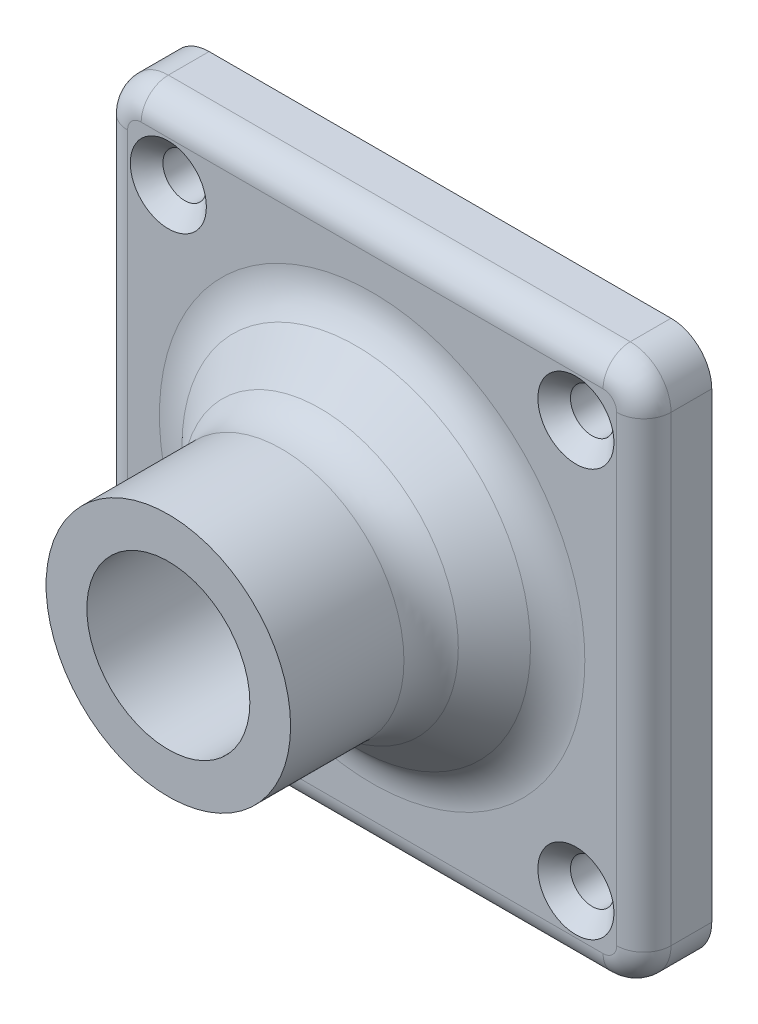
ISO-10303-21;
HEADER;
FILE_DESCRIPTION(('STEP AP214'),'2;1');
FILE_NAME('part.step','',(''),(''),'','','');
FILE_SCHEMA(('AUTOMOTIVE_DESIGN { 1 0 10303 214 1 1 1 1 }'));
ENDSEC;
DATA;
#1=APPLICATION_CONTEXT('core data for automotive mechanical design processes');
#2=APPLICATION_PROTOCOL_DEFINITION('international standard','automotive_design',2000,#1);
#3=PRODUCT_CONTEXT('',#1,'mechanical');
#4=PRODUCT('Part','Part','',(#3));
#5=PRODUCT_RELATED_PRODUCT_CATEGORY('part','',(#4));
#6=PRODUCT_DEFINITION_FORMATION('','',#4);
#7=PRODUCT_DEFINITION_CONTEXT('part definition',#1,'design');
#8=PRODUCT_DEFINITION('design','',#6,#7);
#9=PRODUCT_DEFINITION_SHAPE('','',#8);
#10=(LENGTH_UNIT() NAMED_UNIT(*) SI_UNIT(.MILLI.,.METRE.));
#11=(NAMED_UNIT(*) PLANE_ANGLE_UNIT() SI_UNIT($,.RADIAN.));
#12=(NAMED_UNIT(*) SI_UNIT($,.STERADIAN.) SOLID_ANGLE_UNIT());
#13=UNCERTAINTY_MEASURE_WITH_UNIT(LENGTH_MEASURE(1.E-05),#10,'distance_accuracy_value','');
#14=(GEOMETRIC_REPRESENTATION_CONTEXT(3) GLOBAL_UNCERTAINTY_ASSIGNED_CONTEXT((#13)) GLOBAL_UNIT_ASSIGNED_CONTEXT((#10,
#11,#12)) REPRESENTATION_CONTEXT('',''));
#15=CARTESIAN_POINT('',(0.,0.,0.));
#16=DIRECTION('',(0.,0.,1.));
#17=DIRECTION('',(1.,0.,0.));
#18=AXIS2_PLACEMENT_3D('',#15,#16,#17);
#19=CARTESIAN_POINT('',(-135.000000000005,-82.312657818665,20.));
#20=DIRECTION('',(0.,0.,1.));
#21=DIRECTION('',(1.,0.,0.));
#22=AXIS2_PLACEMENT_3D('',#19,#20,#21);
#23=PLANE('',#22);
#24=CARTESIAN_POINT('',(-135.000000000005,-82.312657818665,20.));
#25=DIRECTION('',(0.,0.,1.));
#26=DIRECTION('',(1.,0.,0.));
#27=AXIS2_PLACEMENT_3D('',#24,#25,#26);
#28=CIRCLE('',#27,9.00000000000001);
#29=CARTESIAN_POINT('',(-126.000000000005,-82.312657818665,20.));
#30=VERTEX_POINT('',#29);
#31=EDGE_CURVE('E190',#30,#30,#28,.T.);
#32=ORIENTED_EDGE('',*,*,#31,.T.);
#33=EDGE_LOOP('',(#32));
#34=FACE_BOUND('',#33,.T.);
#35=CARTESIAN_POINT('',(-135.000000000005,-82.312657818665,20.));
#36=DIRECTION('',(0.,0.,1.));
#37=DIRECTION('',(1.,0.,0.));
#38=AXIS2_PLACEMENT_3D('',#35,#36,#37);
#39=CIRCLE('',#38,5.99999999999999);
#40=CARTESIAN_POINT('',(-129.000000000005,-82.312657818665,20.));
#41=VERTEX_POINT('',#40);
#42=EDGE_CURVE('E187',#41,#41,#39,.T.);
#43=ORIENTED_EDGE('',*,*,#42,.F.);
#44=EDGE_LOOP('',(#43));
#45=FACE_BOUND('',#44,.T.);
#46=ADVANCED_FACE('F34',(#34,#45),#23,.T.);
#47=CARTESIAN_POINT('',(-135.000000000005,-82.312657818665,0.));
#48=DIRECTION('',(0.,0.,1.));
#49=DIRECTION('',(1.,0.,0.));
#50=AXIS2_PLACEMENT_3D('',#47,#48,#49);
#51=PLANE('',#50);
#52=CARTESIAN_POINT('',(-150.000000000005,-97.312657818665,0.));
#53=DIRECTION('',(0.,0.,1.));
#54=DIRECTION('',(1.,0.,0.));
#55=AXIS2_PLACEMENT_3D('',#52,#53,#54);
#56=CIRCLE('',#55,1.59999999999999);
#57=CARTESIAN_POINT('',(-148.400000000005,-97.312657818665,0.));
#58=VERTEX_POINT('',#57);
#59=EDGE_CURVE('E157',#58,#58,#56,.T.);
#60=ORIENTED_EDGE('',*,*,#59,.T.);
#61=EDGE_LOOP('',(#60));
#62=FACE_BOUND('',#61,.T.);
#63=CARTESIAN_POINT('',(-120.000000000005,-97.312657818665,0.));
#64=DIRECTION('',(0.,0.,1.));
#65=DIRECTION('',(1.,0.,0.));
#66=AXIS2_PLACEMENT_3D('',#63,#64,#65);
#67=CIRCLE('',#66,1.59999999999999);
#68=CARTESIAN_POINT('',(-118.400000000005,-97.312657818665,0.));
#69=VERTEX_POINT('',#68);
#70=EDGE_CURVE('E388',#69,#69,#67,.T.);
#71=ORIENTED_EDGE('',*,*,#70,.T.);
#72=EDGE_LOOP('',(#71));
#73=FACE_BOUND('',#72,.T.);
#74=CARTESIAN_POINT('',(-120.000000000005,-67.312657818665,0.));
#75=DIRECTION('',(0.,0.,1.));
#76=DIRECTION('',(1.,0.,0.));
#77=AXIS2_PLACEMENT_3D('',#74,#75,#76);
#78=CIRCLE('',#77,1.59999999999999);
#79=CARTESIAN_POINT('',(-118.400000000005,-67.312657818665,0.));
#80=VERTEX_POINT('',#79);
#81=EDGE_CURVE('E385',#80,#80,#78,.T.);
#82=ORIENTED_EDGE('',*,*,#81,.T.);
#83=EDGE_LOOP('',(#82));
#84=FACE_BOUND('',#83,.T.);
#85=CARTESIAN_POINT('',(-150.000000000005,-67.312657818665,0.));
#86=DIRECTION('',(0.,0.,1.));
#87=DIRECTION('',(1.,0.,0.));
#88=AXIS2_PLACEMENT_3D('',#85,#86,#87);
#89=CIRCLE('',#88,1.59999999999999);
#90=CARTESIAN_POINT('',(-148.400000000005,-67.312657818665,0.));
#91=VERTEX_POINT('',#90);
#92=EDGE_CURVE('E383',#91,#91,#89,.T.);
#93=ORIENTED_EDGE('',*,*,#92,.T.);
#94=EDGE_LOOP('',(#93));
#95=FACE_BOUND('',#94,.T.);
#96=CARTESIAN_POINT('',(-135.000000000005,-82.312657818665,0.));
#97=DIRECTION('',(0.,0.,1.));
#98=DIRECTION('',(1.,0.,0.));
#99=AXIS2_PLACEMENT_3D('',#96,#97,#98);
#100=CIRCLE('',#99,5.99999999999999);
#101=CARTESIAN_POINT('',(-129.000000000005,-82.312657818665,0.));
#102=VERTEX_POINT('',#101);
#103=EDGE_CURVE('E175',#102,#102,#100,.T.);
#104=ORIENTED_EDGE('',*,*,#103,.T.);
#105=EDGE_LOOP('',(#104));
#106=FACE_BOUND('',#105,.T.);
#107=CARTESIAN_POINT('',(-118.000000000005,-99.312657818665,0.));
#108=DIRECTION('',(0.,0.,-1.));
#109=DIRECTION('',(1.,0.,0.));
#110=AXIS2_PLACEMENT_3D('',#107,#108,#109);
#111=CIRCLE('',#110,3.);
#112=CARTESIAN_POINT('',(-115.000000000005,-99.312657818665,0.));
#113=VERTEX_POINT('',#112);
#114=CARTESIAN_POINT('',(-118.000000000005,-102.312657818665,0.));
#115=VERTEX_POINT('',#114);
#116=EDGE_CURVE('E130',#113,#115,#111,.T.);
#117=ORIENTED_EDGE('',*,*,#116,.T.);
#118=DIRECTION('',(-1.,0.,0.));
#119=VECTOR('',#118,1.);
#120=CARTESIAN_POINT('',(-152.000000000005,-102.312657818665,0.));
#121=LINE('',#120,#119);
#122=CARTESIAN_POINT('',(-152.000000000005,-102.312657818665,0.));
#123=VERTEX_POINT('',#122);
#124=EDGE_CURVE('E140',#115,#123,#121,.T.);
#125=ORIENTED_EDGE('',*,*,#124,.T.);
#126=CARTESIAN_POINT('',(-152.000000000005,-99.312657818665,0.));
#127=DIRECTION('',(0.,0.,-1.));
#128=DIRECTION('',(-1.,0.,0.));
#129=AXIS2_PLACEMENT_3D('',#126,#127,#128);
#130=CIRCLE('',#129,3.00000000000002);
#131=CARTESIAN_POINT('',(-155.000000000005,-99.312657818665,0.));
#132=VERTEX_POINT('',#131);
#133=EDGE_CURVE('E146',#123,#132,#130,.T.);
#134=ORIENTED_EDGE('',*,*,#133,.T.);
#135=DIRECTION('',(0.,1.,0.));
#136=VECTOR('',#135,1.);
#137=CARTESIAN_POINT('',(-155.000000000005,-99.312657818665,0.));
#138=LINE('',#137,#136);
#139=CARTESIAN_POINT('',(-155.000000000005,-65.312657818665,0.));
#140=VERTEX_POINT('',#139);
#141=EDGE_CURVE('E161',#132,#140,#138,.T.);
#142=ORIENTED_EDGE('',*,*,#141,.T.);
#143=CARTESIAN_POINT('',(-152.000000000005,-65.312657818665,0.));
#144=DIRECTION('',(0.,0.,-1.));
#145=DIRECTION('',(-1.,0.,0.));
#146=AXIS2_PLACEMENT_3D('',#143,#144,#145);
#147=CIRCLE('',#146,3.);
#148=CARTESIAN_POINT('',(-152.000000000005,-62.312657818665,0.));
#149=VERTEX_POINT('',#148);
#150=EDGE_CURVE('E164',#140,#149,#147,.T.);
#151=ORIENTED_EDGE('',*,*,#150,.T.);
#152=DIRECTION('',(1.,0.,0.));
#153=VECTOR('',#152,1.);
#154=CARTESIAN_POINT('',(-152.000000000005,-62.312657818665,0.));
#155=LINE('',#154,#153);
#156=CARTESIAN_POINT('',(-118.000000000005,-62.312657818665,0.));
#157=VERTEX_POINT('',#156);
#158=EDGE_CURVE('E167',#149,#157,#155,.T.);
#159=ORIENTED_EDGE('',*,*,#158,.T.);
#160=CARTESIAN_POINT('',(-118.000000000005,-65.312657818665,0.));
#161=DIRECTION('',(0.,0.,-1.));
#162=DIRECTION('',(-1.,0.,0.));
#163=AXIS2_PLACEMENT_3D('',#160,#161,#162);
#164=CIRCLE('',#163,2.99999999999999);
#165=CARTESIAN_POINT('',(-115.000000000005,-65.312657818665,0.));
#166=VERTEX_POINT('',#165);
#167=EDGE_CURVE('E170',#157,#166,#164,.T.);
#168=ORIENTED_EDGE('',*,*,#167,.T.);
#169=DIRECTION('',(0.,-1.,0.));
#170=VECTOR('',#169,1.);
#171=CARTESIAN_POINT('',(-115.000000000005,-99.312657818665,0.));
#172=LINE('',#171,#170);
#173=EDGE_CURVE('E137',#166,#113,#172,.T.);
#174=ORIENTED_EDGE('',*,*,#173,.T.);
#175=EDGE_LOOP('',(#117,#125,#134,#142,#151,#159,#168,#174));
#176=FACE_BOUND('',#175,.T.);
#177=ADVANCED_FACE('F148',(#62,#73,#84,#95,#106,#176),#51,.F.);
#178=CARTESIAN_POINT('',(-135.000000000005,-82.312657818665,20.));
#179=DIRECTION('',(0.,0.,-1.));
#180=DIRECTION('',(-1.,0.,0.));
#181=AXIS2_PLACEMENT_3D('',#178,#179,#180);
#182=CYLINDRICAL_SURFACE('',#181,9.00000000000001);
#183=CARTESIAN_POINT('',(-135.000000000005,-82.312657818665,11.6568542494924));
#184=DIRECTION('',(0.,0.,1.));
#185=DIRECTION('',(1.,0.,0.));
#186=AXIS2_PLACEMENT_3D('',#183,#184,#185);
#187=CIRCLE('',#186,9.00000000000001);
#188=CARTESIAN_POINT('',(-126.000000000005,-82.312657818665,11.6568542494924));
#189=VERTEX_POINT('',#188);
#190=EDGE_CURVE('E226',#189,#189,#187,.T.);
#191=ORIENTED_EDGE('',*,*,#190,.T.);
#192=EDGE_LOOP('',(#191));
#193=FACE_BOUND('',#192,.T.);
#194=ORIENTED_EDGE('',*,*,#31,.F.);
#195=EDGE_LOOP('',(#194));
#196=FACE_BOUND('',#195,.T.);
#197=ADVANCED_FACE('F299',(#193,#196),#182,.T.);
#198=CARTESIAN_POINT('',(-135.000000000005,-82.312657818665,20.));
#199=DIRECTION('',(0.,0.,-1.));
#200=DIRECTION('',(-1.,0.,0.));
#201=AXIS2_PLACEMENT_3D('',#198,#199,#200);
#202=CYLINDRICAL_SURFACE('',#201,5.99999999999999);
#203=ORIENTED_EDGE('',*,*,#42,.T.);
#204=EDGE_LOOP('',(#203));
#205=FACE_BOUND('',#204,.T.);
#206=ORIENTED_EDGE('',*,*,#103,.F.);
#207=EDGE_LOOP('',(#206));
#208=FACE_BOUND('',#207,.T.);
#209=ADVANCED_FACE('F304',(#205,#208),#202,.F.);
#210=CARTESIAN_POINT('',(-118.000000000005,-99.312657818665,5.));
#211=DIRECTION('',(0.,0.,1.));
#212=DIRECTION('',(1.,0.,0.));
#213=AXIS2_PLACEMENT_3D('',#210,#211,#212);
#214=PLANE('',#213);
#215=CARTESIAN_POINT('',(-150.000000000005,-67.312657818665,5.));
#216=DIRECTION('',(0.,0.,1.));
#217=DIRECTION('',(1.,0.,0.));
#218=AXIS2_PLACEMENT_3D('',#215,#216,#217);
#219=CIRCLE('',#218,2.8);
#220=CARTESIAN_POINT('',(-147.200000000005,-67.312657818665,5.));
#221=VERTEX_POINT('',#220);
#222=EDGE_CURVE('E268',#221,#221,#219,.F.);
#223=ORIENTED_EDGE('',*,*,#222,.T.);
#224=EDGE_LOOP('',(#223));
#225=FACE_BOUND('',#224,.T.);
#226=CARTESIAN_POINT('',(-120.000000000005,-67.312657818665,5.));
#227=DIRECTION('',(0.,0.,1.));
#228=DIRECTION('',(1.,0.,0.));
#229=AXIS2_PLACEMENT_3D('',#226,#227,#228);
#230=CIRCLE('',#229,2.8);
#231=CARTESIAN_POINT('',(-117.200000000005,-67.312657818665,5.));
#232=VERTEX_POINT('',#231);
#233=EDGE_CURVE('E265',#232,#232,#230,.F.);
#234=ORIENTED_EDGE('',*,*,#233,.T.);
#235=EDGE_LOOP('',(#234));
#236=FACE_BOUND('',#235,.T.);
#237=CARTESIAN_POINT('',(-120.000000000005,-97.312657818665,5.));
#238=DIRECTION('',(0.,0.,1.));
#239=DIRECTION('',(1.,0.,0.));
#240=AXIS2_PLACEMENT_3D('',#237,#238,#239);
#241=CIRCLE('',#240,2.8);
#242=CARTESIAN_POINT('',(-117.200000000005,-97.312657818665,5.));
#243=VERTEX_POINT('',#242);
#244=EDGE_CURVE('E262',#243,#243,#241,.F.);
#245=ORIENTED_EDGE('',*,*,#244,.T.);
#246=EDGE_LOOP('',(#245));
#247=FACE_BOUND('',#246,.T.);
#248=CARTESIAN_POINT('',(-150.000000000005,-97.312657818665,5.));
#249=DIRECTION('',(0.,0.,1.));
#250=DIRECTION('',(1.,0.,0.));
#251=AXIS2_PLACEMENT_3D('',#248,#249,#250);
#252=CIRCLE('',#251,2.8);
#253=CARTESIAN_POINT('',(-147.200000000005,-97.312657818665,5.));
#254=VERTEX_POINT('',#253);
#255=EDGE_CURVE('E259',#254,#254,#252,.F.);
#256=ORIENTED_EDGE('',*,*,#255,.T.);
#257=EDGE_LOOP('',(#256));
#258=FACE_BOUND('',#257,.T.);
#259=CARTESIAN_POINT('',(-135.000000000005,-82.312657818665,5.));
#260=DIRECTION('',(0.,0.,1.));
#261=DIRECTION('',(1.,0.,0.));
#262=AXIS2_PLACEMENT_3D('',#259,#260,#261);
#263=CIRCLE('',#262,15.6568542494924);
#264=CARTESIAN_POINT('',(-119.343145750513,-82.312657818665,5.));
#265=VERTEX_POINT('',#264);
#266=EDGE_CURVE('E253',#265,#265,#263,.F.);
#267=ORIENTED_EDGE('',*,*,#266,.T.);
#268=EDGE_LOOP('',(#267));
#269=FACE_BOUND('',#268,.T.);
#270=DIRECTION('',(0.,1.,0.));
#271=VECTOR('',#270,1.);
#272=CARTESIAN_POINT('',(-153.000000000005,-99.312657818665,5.));
#273=LINE('',#272,#271);
#274=CARTESIAN_POINT('',(-153.000000000005,-65.312657818665,5.));
#275=VERTEX_POINT('',#274);
#276=CARTESIAN_POINT('',(-153.000000000005,-99.312657818665,5.));
#277=VERTEX_POINT('',#276);
#278=EDGE_CURVE('E198',#275,#277,#273,.F.);
#279=ORIENTED_EDGE('',*,*,#278,.T.);
#280=CARTESIAN_POINT('',(-152.000000000005,-99.312657818665,5.));
#281=DIRECTION('',(0.,0.,1.));
#282=DIRECTION('',(1.,0.,0.));
#283=AXIS2_PLACEMENT_3D('',#280,#281,#282);
#284=CIRCLE('',#283,1.00000000000002);
#285=CARTESIAN_POINT('',(-152.000000000005,-100.312657818665,5.));
#286=VERTEX_POINT('',#285);
#287=EDGE_CURVE('E212',#277,#286,#284,.T.);
#288=ORIENTED_EDGE('',*,*,#287,.T.);
#289=DIRECTION('',(-1.,0.,0.));
#290=VECTOR('',#289,1.);
#291=CARTESIAN_POINT('',(-118.000000000005,-100.312657818665,5.));
#292=LINE('',#291,#290);
#293=CARTESIAN_POINT('',(-118.000000000005,-100.312657818665,5.));
#294=VERTEX_POINT('',#293);
#295=EDGE_CURVE('E210',#286,#294,#292,.F.);
#296=ORIENTED_EDGE('',*,*,#295,.T.);
#297=CARTESIAN_POINT('',(-118.000000000005,-99.312657818665,5.));
#298=DIRECTION('',(0.,0.,1.));
#299=DIRECTION('',(1.,0.,0.));
#300=AXIS2_PLACEMENT_3D('',#297,#298,#299);
#301=CIRCLE('',#300,1.);
#302=CARTESIAN_POINT('',(-117.000000000005,-99.312657818665,5.));
#303=VERTEX_POINT('',#302);
#304=EDGE_CURVE('E208',#294,#303,#301,.T.);
#305=ORIENTED_EDGE('',*,*,#304,.T.);
#306=DIRECTION('',(0.,-1.,0.));
#307=VECTOR('',#306,1.);
#308=CARTESIAN_POINT('',(-117.000000000005,-99.312657818665,5.));
#309=LINE('',#308,#307);
#310=CARTESIAN_POINT('',(-117.000000000005,-65.312657818665,5.));
#311=VERTEX_POINT('',#310);
#312=EDGE_CURVE('E206',#303,#311,#309,.F.);
#313=ORIENTED_EDGE('',*,*,#312,.T.);
#314=CARTESIAN_POINT('',(-118.000000000005,-65.312657818665,5.));
#315=DIRECTION('',(0.,0.,1.));
#316=DIRECTION('',(1.,0.,0.));
#317=AXIS2_PLACEMENT_3D('',#314,#315,#316);
#318=CIRCLE('',#317,0.999999999999992);
#319=CARTESIAN_POINT('',(-118.000000000005,-64.312657818665,5.));
#320=VERTEX_POINT('',#319);
#321=EDGE_CURVE('E204',#311,#320,#318,.T.);
#322=ORIENTED_EDGE('',*,*,#321,.T.);
#323=DIRECTION('',(1.,0.,0.));
#324=VECTOR('',#323,1.);
#325=CARTESIAN_POINT('',(-118.000000000005,-64.312657818665,5.));
#326=LINE('',#325,#324);
#327=CARTESIAN_POINT('',(-152.000000000005,-64.312657818665,5.));
#328=VERTEX_POINT('',#327);
#329=EDGE_CURVE('E202',#320,#328,#326,.F.);
#330=ORIENTED_EDGE('',*,*,#329,.T.);
#331=CARTESIAN_POINT('',(-152.000000000005,-65.312657818665,5.));
#332=DIRECTION('',(0.,0.,1.));
#333=DIRECTION('',(1.,0.,0.));
#334=AXIS2_PLACEMENT_3D('',#331,#332,#333);
#335=CIRCLE('',#334,0.999999999999999);
#336=EDGE_CURVE('E200',#328,#275,#335,.T.);
#337=ORIENTED_EDGE('',*,*,#336,.T.);
#338=EDGE_LOOP('',(#279,#288,#296,#305,#313,#322,#330,#337));
#339=FACE_BOUND('',#338,.T.);
#340=ADVANCED_FACE('F405',(#225,#236,#247,#258,#269,#339),#214,.T.);
#341=CARTESIAN_POINT('',(-118.000000000005,-99.312657818665,5.));
#342=DIRECTION('',(0.,0.,-1.));
#343=DIRECTION('',(-1.,0.,0.));
#344=AXIS2_PLACEMENT_3D('',#341,#342,#343);
#345=CYLINDRICAL_SURFACE('',#344,3.);
#346=DIRECTION('',(0.,0.,-1.));
#347=VECTOR('',#346,1.);
#348=CARTESIAN_POINT('',(-115.000000000005,-99.312657818665,5.));
#349=LINE('',#348,#347);
#350=CARTESIAN_POINT('',(-115.000000000005,-99.312657818665,3.));
#351=VERTEX_POINT('',#350);
#352=EDGE_CURVE('E173',#351,#113,#349,.T.);
#353=ORIENTED_EDGE('',*,*,#352,.F.);
#354=CARTESIAN_POINT('',(-118.000000000005,-99.312657818665,3.));
#355=DIRECTION('',(0.,0.,1.));
#356=DIRECTION('',(1.,0.,0.));
#357=AXIS2_PLACEMENT_3D('',#354,#355,#356);
#358=CIRCLE('',#357,3.);
#359=CARTESIAN_POINT('',(-118.000000000005,-102.312657818665,3.));
#360=VERTEX_POINT('',#359);
#361=EDGE_CURVE('E133',#351,#360,#358,.F.);
#362=ORIENTED_EDGE('',*,*,#361,.T.);
#363=DIRECTION('',(0.,0.,-1.));
#364=VECTOR('',#363,1.);
#365=CARTESIAN_POINT('',(-118.000000000005,-102.312657818665,5.));
#366=LINE('',#365,#364);
#367=EDGE_CURVE('E125',#360,#115,#366,.T.);
#368=ORIENTED_EDGE('',*,*,#367,.T.);
#369=ORIENTED_EDGE('',*,*,#116,.F.);
#370=EDGE_LOOP('',(#353,#362,#368,#369));
#371=FACE_BOUND('',#370,.T.);
#372=ADVANCED_FACE('F128',(#371),#345,.T.);
#373=CARTESIAN_POINT('',(-115.000000000005,-99.312657818665,5.));
#374=DIRECTION('',(1.,0.,0.));
#375=DIRECTION('',(0.,0.,-1.));
#376=AXIS2_PLACEMENT_3D('',#373,#374,#375);
#377=PLANE('',#376);
#378=DIRECTION('',(0.,0.,-1.));
#379=VECTOR('',#378,1.);
#380=CARTESIAN_POINT('',(-115.000000000005,-65.312657818665,5.));
#381=LINE('',#380,#379);
#382=CARTESIAN_POINT('',(-115.000000000005,-65.312657818665,3.));
#383=VERTEX_POINT('',#382);
#384=EDGE_CURVE('E176',#383,#166,#381,.T.);
#385=ORIENTED_EDGE('',*,*,#384,.F.);
#386=DIRECTION('',(0.,-1.,0.));
#387=VECTOR('',#386,1.);
#388=CARTESIAN_POINT('',(-115.000000000005,-99.312657818665,3.));
#389=LINE('',#388,#387);
#390=EDGE_CURVE('E218',#383,#351,#389,.T.);
#391=ORIENTED_EDGE('',*,*,#390,.T.);
#392=ORIENTED_EDGE('',*,*,#352,.T.);
#393=ORIENTED_EDGE('',*,*,#173,.F.);
#394=EDGE_LOOP('',(#385,#391,#392,#393));
#395=FACE_BOUND('',#394,.T.);
#396=ADVANCED_FACE('F409',(#395),#377,.T.);
#397=CARTESIAN_POINT('',(-118.000000000005,-65.312657818665,5.));
#398=DIRECTION('',(0.,0.,-1.));
#399=DIRECTION('',(-1.,0.,0.));
#400=AXIS2_PLACEMENT_3D('',#397,#398,#399);
#401=CYLINDRICAL_SURFACE('',#400,2.99999999999999);
#402=DIRECTION('',(0.,0.,-1.));
#403=VECTOR('',#402,1.);
#404=CARTESIAN_POINT('',(-118.000000000005,-62.312657818665,5.));
#405=LINE('',#404,#403);
#406=CARTESIAN_POINT('',(-118.000000000005,-62.312657818665,3.));
#407=VERTEX_POINT('',#406);
#408=EDGE_CURVE('E178',#407,#157,#405,.T.);
#409=ORIENTED_EDGE('',*,*,#408,.F.);
#410=CARTESIAN_POINT('',(-118.000000000005,-65.312657818665,3.));
#411=DIRECTION('',(0.,0.,1.));
#412=DIRECTION('',(1.,0.,0.));
#413=AXIS2_PLACEMENT_3D('',#410,#411,#412);
#414=CIRCLE('',#413,2.99999999999999);
#415=EDGE_CURVE('E220',#407,#383,#414,.F.);
#416=ORIENTED_EDGE('',*,*,#415,.T.);
#417=ORIENTED_EDGE('',*,*,#384,.T.);
#418=ORIENTED_EDGE('',*,*,#167,.F.);
#419=EDGE_LOOP('',(#409,#416,#417,#418));
#420=FACE_BOUND('',#419,.T.);
#421=ADVANCED_FACE('F412',(#420),#401,.T.);
#422=CARTESIAN_POINT('',(-152.000000000005,-62.312657818665,5.));
#423=DIRECTION('',(0.,1.,0.));
#424=DIRECTION('',(-1.,0.,0.));
#425=AXIS2_PLACEMENT_3D('',#422,#423,#424);
#426=PLANE('',#425);
#427=DIRECTION('',(0.,0.,-1.));
#428=VECTOR('',#427,1.);
#429=CARTESIAN_POINT('',(-152.000000000005,-62.312657818665,5.));
#430=LINE('',#429,#428);
#431=CARTESIAN_POINT('',(-152.000000000005,-62.312657818665,3.));
#432=VERTEX_POINT('',#431);
#433=EDGE_CURVE('E180',#432,#149,#430,.T.);
#434=ORIENTED_EDGE('',*,*,#433,.F.);
#435=DIRECTION('',(1.,0.,0.));
#436=VECTOR('',#435,1.);
#437=CARTESIAN_POINT('',(-152.000000000005,-62.312657818665,3.));
#438=LINE('',#437,#436);
#439=EDGE_CURVE('E222',#432,#407,#438,.T.);
#440=ORIENTED_EDGE('',*,*,#439,.T.);
#441=ORIENTED_EDGE('',*,*,#408,.T.);
#442=ORIENTED_EDGE('',*,*,#158,.F.);
#443=EDGE_LOOP('',(#434,#440,#441,#442));
#444=FACE_BOUND('',#443,.T.);
#445=ADVANCED_FACE('F416',(#444),#426,.T.);
#446=CARTESIAN_POINT('',(-152.000000000005,-65.312657818665,5.));
#447=DIRECTION('',(0.,0.,-1.));
#448=DIRECTION('',(-1.,0.,0.));
#449=AXIS2_PLACEMENT_3D('',#446,#447,#448);
#450=CYLINDRICAL_SURFACE('',#449,3.);
#451=DIRECTION('',(0.,0.,-1.));
#452=VECTOR('',#451,1.);
#453=CARTESIAN_POINT('',(-155.000000000005,-65.312657818665,5.));
#454=LINE('',#453,#452);
#455=CARTESIAN_POINT('',(-155.000000000005,-65.312657818665,3.));
#456=VERTEX_POINT('',#455);
#457=EDGE_CURVE('E182',#456,#140,#454,.T.);
#458=ORIENTED_EDGE('',*,*,#457,.F.);
#459=CARTESIAN_POINT('',(-152.000000000005,-65.312657818665,3.));
#460=DIRECTION('',(0.,0.,1.));
#461=DIRECTION('',(1.,0.,0.));
#462=AXIS2_PLACEMENT_3D('',#459,#460,#461);
#463=CIRCLE('',#462,3.);
#464=EDGE_CURVE('E57',#456,#432,#463,.F.);
#465=ORIENTED_EDGE('',*,*,#464,.T.);
#466=ORIENTED_EDGE('',*,*,#433,.T.);
#467=ORIENTED_EDGE('',*,*,#150,.F.);
#468=EDGE_LOOP('',(#458,#465,#466,#467));
#469=FACE_BOUND('',#468,.T.);
#470=ADVANCED_FACE('F420',(#469),#450,.T.);
#471=CARTESIAN_POINT('',(-155.000000000005,-99.312657818665,5.));
#472=DIRECTION('',(-1.,0.,0.));
#473=DIRECTION('',(0.,-1.,0.));
#474=AXIS2_PLACEMENT_3D('',#471,#472,#473);
#475=PLANE('',#474);
#476=DIRECTION('',(0.,0.,-1.));
#477=VECTOR('',#476,1.);
#478=CARTESIAN_POINT('',(-155.000000000005,-99.312657818665,5.));
#479=LINE('',#478,#477);
#480=CARTESIAN_POINT('',(-155.000000000005,-99.312657818665,3.));
#481=VERTEX_POINT('',#480);
#482=EDGE_CURVE('E184',#481,#132,#479,.T.);
#483=ORIENTED_EDGE('',*,*,#482,.F.);
#484=DIRECTION('',(0.,1.,0.));
#485=VECTOR('',#484,1.);
#486=CARTESIAN_POINT('',(-155.000000000005,-99.312657818665,3.));
#487=LINE('',#486,#485);
#488=EDGE_CURVE('E50',#481,#456,#487,.T.);
#489=ORIENTED_EDGE('',*,*,#488,.T.);
#490=ORIENTED_EDGE('',*,*,#457,.T.);
#491=ORIENTED_EDGE('',*,*,#141,.F.);
#492=EDGE_LOOP('',(#483,#489,#490,#491));
#493=FACE_BOUND('',#492,.T.);
#494=ADVANCED_FACE('F424',(#493),#475,.T.);
#495=CARTESIAN_POINT('',(-152.000000000005,-99.312657818665,5.));
#496=DIRECTION('',(0.,0.,-1.));
#497=DIRECTION('',(-1.,0.,0.));
#498=AXIS2_PLACEMENT_3D('',#495,#496,#497);
#499=CYLINDRICAL_SURFACE('',#498,3.00000000000002);
#500=DIRECTION('',(0.,0.,-1.));
#501=VECTOR('',#500,1.);
#502=CARTESIAN_POINT('',(-152.000000000005,-102.312657818665,5.));
#503=LINE('',#502,#501);
#504=CARTESIAN_POINT('',(-152.000000000005,-102.312657818665,3.));
#505=VERTEX_POINT('',#504);
#506=EDGE_CURVE('E136',#505,#123,#503,.T.);
#507=ORIENTED_EDGE('',*,*,#506,.F.);
#508=CARTESIAN_POINT('',(-152.000000000005,-99.312657818665,3.));
#509=DIRECTION('',(0.,0.,1.));
#510=DIRECTION('',(1.,0.,0.));
#511=AXIS2_PLACEMENT_3D('',#508,#509,#510);
#512=CIRCLE('',#511,3.00000000000002);
#513=EDGE_CURVE('E195',#505,#481,#512,.F.);
#514=ORIENTED_EDGE('',*,*,#513,.T.);
#515=ORIENTED_EDGE('',*,*,#482,.T.);
#516=ORIENTED_EDGE('',*,*,#133,.F.);
#517=EDGE_LOOP('',(#507,#514,#515,#516));
#518=FACE_BOUND('',#517,.T.);
#519=ADVANCED_FACE('F427',(#518),#499,.T.);
#520=CARTESIAN_POINT('',(-152.000000000005,-102.312657818665,5.));
#521=DIRECTION('',(0.,-1.,0.));
#522=DIRECTION('',(1.,0.,0.));
#523=AXIS2_PLACEMENT_3D('',#520,#521,#522);
#524=PLANE('',#523);
#525=ORIENTED_EDGE('',*,*,#367,.F.);
#526=DIRECTION('',(-1.,0.,0.));
#527=VECTOR('',#526,1.);
#528=CARTESIAN_POINT('',(-152.000000000005,-102.312657818665,3.));
#529=LINE('',#528,#527);
#530=EDGE_CURVE('E215',#360,#505,#529,.T.);
#531=ORIENTED_EDGE('',*,*,#530,.T.);
#532=ORIENTED_EDGE('',*,*,#506,.T.);
#533=ORIENTED_EDGE('',*,*,#124,.F.);
#534=EDGE_LOOP('',(#525,#531,#532,#533));
#535=FACE_BOUND('',#534,.T.);
#536=ADVANCED_FACE('F141',(#535),#524,.T.);
#537=CARTESIAN_POINT('',(-118.000000000005,-65.312657818665,3.));
#538=DIRECTION('',(0.,0.,1.));
#539=DIRECTION('',(1.,0.,0.));
#540=AXIS2_PLACEMENT_3D('',#537,#538,#539);
#541=DEGENERATE_TOROIDAL_SURFACE('',#540,0.999999999999992,2.,.T.);
#542=CARTESIAN_POINT('',(-118.000000000005,-64.312657818665,3.));
#543=DIRECTION('',(-1.,0.,0.));
#544=DIRECTION('',(0.,0.,1.));
#545=AXIS2_PLACEMENT_3D('',#542,#543,#544);
#546=CIRCLE('',#545,2.);
#547=EDGE_CURVE('E154',#320,#407,#546,.T.);
#548=ORIENTED_EDGE('',*,*,#547,.F.);
#549=ORIENTED_EDGE('',*,*,#321,.F.);
#550=CARTESIAN_POINT('',(-117.000000000005,-65.312657818665,3.));
#551=DIRECTION('',(0.,-1.,0.));
#552=DIRECTION('',(0.,0.,-1.));
#553=AXIS2_PLACEMENT_3D('',#550,#551,#552);
#554=CIRCLE('',#553,2.);
#555=EDGE_CURVE('E151',#383,#311,#554,.T.);
#556=ORIENTED_EDGE('',*,*,#555,.F.);
#557=ORIENTED_EDGE('',*,*,#415,.F.);
#558=EDGE_LOOP('',(#548,#549,#556,#557));
#559=FACE_BOUND('',#558,.T.);
#560=ADVANCED_FACE('F338',(#559),#541,.T.);
#561=CARTESIAN_POINT('',(-117.000000000005,-99.312657818665,3.));
#562=DIRECTION('',(0.,-1.,0.));
#563=DIRECTION('',(0.,0.,-1.));
#564=AXIS2_PLACEMENT_3D('',#561,#562,#563);
#565=CYLINDRICAL_SURFACE('',#564,2.);
#566=ORIENTED_EDGE('',*,*,#555,.T.);
#567=ORIENTED_EDGE('',*,*,#312,.F.);
#568=CARTESIAN_POINT('',(-117.000000000005,-99.312657818665,3.));
#569=DIRECTION('',(0.,-1.,0.));
#570=DIRECTION('',(0.,0.,-1.));
#571=AXIS2_PLACEMENT_3D('',#568,#569,#570);
#572=CIRCLE('',#571,2.);
#573=EDGE_CURVE('E240',#351,#303,#572,.T.);
#574=ORIENTED_EDGE('',*,*,#573,.F.);
#575=ORIENTED_EDGE('',*,*,#390,.F.);
#576=EDGE_LOOP('',(#566,#567,#574,#575));
#577=FACE_BOUND('',#576,.T.);
#578=ADVANCED_FACE('F334',(#577),#565,.T.);
#579=CARTESIAN_POINT('',(-152.000000000005,-64.312657818665,3.));
#580=DIRECTION('',(1.,0.,0.));
#581=DIRECTION('',(0.,1.,0.));
#582=AXIS2_PLACEMENT_3D('',#579,#580,#581);
#583=CYLINDRICAL_SURFACE('',#582,2.);
#584=ORIENTED_EDGE('',*,*,#547,.T.);
#585=ORIENTED_EDGE('',*,*,#439,.F.);
#586=CARTESIAN_POINT('',(-152.000000000005,-64.312657818665,3.));
#587=DIRECTION('',(-1.,0.,0.));
#588=DIRECTION('',(0.,0.,1.));
#589=AXIS2_PLACEMENT_3D('',#586,#587,#588);
#590=CIRCLE('',#589,2.);
#591=EDGE_CURVE('E237',#328,#432,#590,.T.);
#592=ORIENTED_EDGE('',*,*,#591,.F.);
#593=ORIENTED_EDGE('',*,*,#329,.F.);
#594=EDGE_LOOP('',(#584,#585,#592,#593));
#595=FACE_BOUND('',#594,.T.);
#596=ADVANCED_FACE('F330',(#595),#583,.T.);
#597=CARTESIAN_POINT('',(-118.000000000005,-99.312657818665,3.));
#598=DIRECTION('',(0.,0.,1.));
#599=DIRECTION('',(1.,0.,0.));
#600=AXIS2_PLACEMENT_3D('',#597,#598,#599);
#601=DEGENERATE_TOROIDAL_SURFACE('',#600,1.,2.,.T.);
#602=ORIENTED_EDGE('',*,*,#573,.T.);
#603=ORIENTED_EDGE('',*,*,#304,.F.);
#604=CARTESIAN_POINT('',(-118.000000000005,-100.312657818665,3.));
#605=DIRECTION('',(-1.,0.,0.));
#606=DIRECTION('',(0.,0.,1.));
#607=AXIS2_PLACEMENT_3D('',#604,#605,#606);
#608=CIRCLE('',#607,2.);
#609=EDGE_CURVE('E234',#360,#294,#608,.T.);
#610=ORIENTED_EDGE('',*,*,#609,.F.);
#611=ORIENTED_EDGE('',*,*,#361,.F.);
#612=EDGE_LOOP('',(#602,#603,#610,#611));
#613=FACE_BOUND('',#612,.T.);
#614=ADVANCED_FACE('F326',(#613),#601,.T.);
#615=CARTESIAN_POINT('',(-152.000000000005,-65.312657818665,3.));
#616=DIRECTION('',(0.,0.,1.));
#617=DIRECTION('',(1.,0.,0.));
#618=AXIS2_PLACEMENT_3D('',#615,#616,#617);
#619=DEGENERATE_TOROIDAL_SURFACE('',#618,0.999999999999999,2.,.T.);
#620=ORIENTED_EDGE('',*,*,#591,.T.);
#621=ORIENTED_EDGE('',*,*,#464,.F.);
#622=CARTESIAN_POINT('',(-153.000000000005,-65.312657818665,3.));
#623=DIRECTION('',(0.,-1.,0.));
#624=DIRECTION('',(0.,0.,-1.));
#625=AXIS2_PLACEMENT_3D('',#622,#623,#624);
#626=CIRCLE('',#625,2.);
#627=EDGE_CURVE('E231',#275,#456,#626,.T.);
#628=ORIENTED_EDGE('',*,*,#627,.F.);
#629=ORIENTED_EDGE('',*,*,#336,.F.);
#630=EDGE_LOOP('',(#620,#621,#628,#629));
#631=FACE_BOUND('',#630,.T.);
#632=ADVANCED_FACE('F322',(#631),#619,.T.);
#633=CARTESIAN_POINT('',(-152.000000000005,-100.312657818665,3.));
#634=DIRECTION('',(-1.,0.,0.));
#635=DIRECTION('',(0.,-1.,0.));
#636=AXIS2_PLACEMENT_3D('',#633,#634,#635);
#637=CYLINDRICAL_SURFACE('',#636,2.);
#638=ORIENTED_EDGE('',*,*,#609,.T.);
#639=ORIENTED_EDGE('',*,*,#295,.F.);
#640=CARTESIAN_POINT('',(-152.000000000005,-100.312657818665,3.));
#641=DIRECTION('',(-1.,0.,0.));
#642=DIRECTION('',(0.,0.,1.));
#643=AXIS2_PLACEMENT_3D('',#640,#641,#642);
#644=CIRCLE('',#643,2.);
#645=EDGE_CURVE('E229',#505,#286,#644,.T.);
#646=ORIENTED_EDGE('',*,*,#645,.F.);
#647=ORIENTED_EDGE('',*,*,#530,.F.);
#648=EDGE_LOOP('',(#638,#639,#646,#647));
#649=FACE_BOUND('',#648,.T.);
#650=ADVANCED_FACE('F318',(#649),#637,.T.);
#651=CARTESIAN_POINT('',(-153.000000000005,-99.312657818665,3.));
#652=DIRECTION('',(0.,1.,0.));
#653=DIRECTION('',(-1.,0.,0.));
#654=AXIS2_PLACEMENT_3D('',#651,#652,#653);
#655=CYLINDRICAL_SURFACE('',#654,2.);
#656=ORIENTED_EDGE('',*,*,#627,.T.);
#657=ORIENTED_EDGE('',*,*,#488,.F.);
#658=CARTESIAN_POINT('',(-153.000000000005,-99.312657818665,3.));
#659=DIRECTION('',(0.,-1.,0.));
#660=DIRECTION('',(0.,0.,-1.));
#661=AXIS2_PLACEMENT_3D('',#658,#659,#660);
#662=CIRCLE('',#661,2.);
#663=EDGE_CURVE('E227',#277,#481,#662,.T.);
#664=ORIENTED_EDGE('',*,*,#663,.F.);
#665=ORIENTED_EDGE('',*,*,#278,.F.);
#666=EDGE_LOOP('',(#656,#657,#664,#665));
#667=FACE_BOUND('',#666,.T.);
#668=ADVANCED_FACE('F314',(#667),#655,.T.);
#669=CARTESIAN_POINT('',(-152.000000000005,-99.312657818665,3.));
#670=DIRECTION('',(0.,0.,1.));
#671=DIRECTION('',(1.,0.,0.));
#672=AXIS2_PLACEMENT_3D('',#669,#670,#671);
#673=DEGENERATE_TOROIDAL_SURFACE('',#672,1.00000000000002,2.,.T.);
#674=ORIENTED_EDGE('',*,*,#645,.T.);
#675=ORIENTED_EDGE('',*,*,#287,.F.);
#676=ORIENTED_EDGE('',*,*,#663,.T.);
#677=ORIENTED_EDGE('',*,*,#513,.F.);
#678=EDGE_LOOP('',(#674,#675,#676,#677));
#679=FACE_BOUND('',#678,.T.);
#680=ADVANCED_FACE('F310',(#679),#673,.T.);
#681=CARTESIAN_POINT('',(-150.000000000005,-67.312657818665,-6.52548339959243));
#682=DIRECTION('',(0.,0.,1.));
#683=DIRECTION('',(1.,0.,0.));
#684=AXIS2_PLACEMENT_3D('',#681,#682,#683);
#685=CYLINDRICAL_SURFACE('',#684,1.59999999999999);
#686=CARTESIAN_POINT('',(-150.000000000005,-67.312657818665,3.8));
#687=DIRECTION('',(0.,0.,1.));
#688=DIRECTION('',(1.,0.,0.));
#689=AXIS2_PLACEMENT_3D('',#686,#687,#688);
#690=CIRCLE('',#689,1.59999999999999);
#691=CARTESIAN_POINT('',(-148.400000000005,-67.312657818665,3.8));
#692=VERTEX_POINT('',#691);
#693=EDGE_CURVE('E256',#692,#692,#690,.T.);
#694=ORIENTED_EDGE('',*,*,#693,.T.);
#695=EDGE_LOOP('',(#694));
#696=FACE_BOUND('',#695,.T.);
#697=ORIENTED_EDGE('',*,*,#92,.F.);
#698=EDGE_LOOP('',(#697));
#699=FACE_BOUND('',#698,.T.);
#700=ADVANCED_FACE('F313',(#696,#699),#685,.F.);
#701=CARTESIAN_POINT('',(-120.000000000005,-67.312657818665,-6.52548339959243));
#702=DIRECTION('',(0.,0.,1.));
#703=DIRECTION('',(1.,0.,0.));
#704=AXIS2_PLACEMENT_3D('',#701,#702,#703);
#705=CYLINDRICAL_SURFACE('',#704,1.59999999999999);
#706=CARTESIAN_POINT('',(-120.000000000005,-67.312657818665,3.8));
#707=DIRECTION('',(0.,0.,1.));
#708=DIRECTION('',(1.,0.,0.));
#709=AXIS2_PLACEMENT_3D('',#706,#707,#708);
#710=CIRCLE('',#709,1.59999999999999);
#711=CARTESIAN_POINT('',(-118.400000000005,-67.312657818665,3.8));
#712=VERTEX_POINT('',#711);
#713=EDGE_CURVE('E271',#712,#712,#710,.T.);
#714=ORIENTED_EDGE('',*,*,#713,.T.);
#715=EDGE_LOOP('',(#714));
#716=FACE_BOUND('',#715,.T.);
#717=ORIENTED_EDGE('',*,*,#81,.F.);
#718=EDGE_LOOP('',(#717));
#719=FACE_BOUND('',#718,.T.);
#720=ADVANCED_FACE('F379',(#716,#719),#705,.F.);
#721=CARTESIAN_POINT('',(-120.000000000005,-97.312657818665,-6.52548339959243));
#722=DIRECTION('',(0.,0.,1.));
#723=DIRECTION('',(1.,0.,0.));
#724=AXIS2_PLACEMENT_3D('',#721,#722,#723);
#725=CYLINDRICAL_SURFACE('',#724,1.59999999999999);
#726=CARTESIAN_POINT('',(-120.000000000005,-97.312657818665,3.8));
#727=DIRECTION('',(0.,0.,1.));
#728=DIRECTION('',(1.,0.,0.));
#729=AXIS2_PLACEMENT_3D('',#726,#727,#728);
#730=CIRCLE('',#729,1.59999999999999);
#731=CARTESIAN_POINT('',(-118.400000000005,-97.312657818665,3.8));
#732=VERTEX_POINT('',#731);
#733=EDGE_CURVE('E43',#732,#732,#730,.T.);
#734=ORIENTED_EDGE('',*,*,#733,.T.);
#735=EDGE_LOOP('',(#734));
#736=FACE_BOUND('',#735,.T.);
#737=ORIENTED_EDGE('',*,*,#70,.F.);
#738=EDGE_LOOP('',(#737));
#739=FACE_BOUND('',#738,.T.);
#740=ADVANCED_FACE('F276',(#736,#739),#725,.F.);
#741=CARTESIAN_POINT('',(-150.000000000005,-97.312657818665,-6.52548339959243));
#742=DIRECTION('',(0.,0.,1.));
#743=DIRECTION('',(1.,0.,0.));
#744=AXIS2_PLACEMENT_3D('',#741,#742,#743);
#745=CYLINDRICAL_SURFACE('',#744,1.59999999999999);
#746=CARTESIAN_POINT('',(-150.000000000005,-97.312657818665,3.8));
#747=DIRECTION('',(0.,0.,1.));
#748=DIRECTION('',(1.,0.,0.));
#749=AXIS2_PLACEMENT_3D('',#746,#747,#748);
#750=CIRCLE('',#749,1.59999999999999);
#751=CARTESIAN_POINT('',(-148.400000000005,-97.312657818665,3.8));
#752=VERTEX_POINT('',#751);
#753=EDGE_CURVE('E11',#752,#752,#750,.T.);
#754=ORIENTED_EDGE('',*,*,#753,.T.);
#755=EDGE_LOOP('',(#754));
#756=FACE_BOUND('',#755,.T.);
#757=ORIENTED_EDGE('',*,*,#59,.F.);
#758=EDGE_LOOP('',(#757));
#759=FACE_BOUND('',#758,.T.);
#760=ADVANCED_FACE('F351',(#756,#759),#745,.F.);
#761=CARTESIAN_POINT('',(-135.000000000005,-82.312657818665,10.));
#762=DIRECTION('',(0.,0.,-1.));
#763=DIRECTION('',(-1.,0.,0.));
#764=AXIS2_PLACEMENT_3D('',#761,#762,#763);
#765=CONICAL_SURFACE('',#764,9.00000000000001,0.785398163397442);
#766=CARTESIAN_POINT('',(-135.000000000005,-82.312657818665,8.82842712474624));
#767=DIRECTION('',(0.,0.,-1.));
#768=DIRECTION('',(-1.,0.,0.));
#769=AXIS2_PLACEMENT_3D('',#766,#767,#768);
#770=CIRCLE('',#769,10.1715728752538);
#771=CARTESIAN_POINT('',(-145.171572875259,-82.312657818665,8.82842712474624));
#772=VERTEX_POINT('',#771);
#773=EDGE_CURVE('E250',#772,#772,#770,.T.);
#774=ORIENTED_EDGE('',*,*,#773,.T.);
#775=EDGE_LOOP('',(#774));
#776=FACE_BOUND('',#775,.T.);
#777=CARTESIAN_POINT('',(-135.000000000005,-82.312657818665,6.17157287525383));
#778=DIRECTION('',(0.,0.,1.));
#779=DIRECTION('',(1.,0.,0.));
#780=AXIS2_PLACEMENT_3D('',#777,#778,#779);
#781=CIRCLE('',#780,12.8284271247462);
#782=CARTESIAN_POINT('',(-122.171572875259,-82.312657818665,6.17157287525383));
#783=VERTEX_POINT('',#782);
#784=EDGE_CURVE('E247',#783,#783,#781,.T.);
#785=ORIENTED_EDGE('',*,*,#784,.T.);
#786=EDGE_LOOP('',(#785));
#787=FACE_BOUND('',#786,.T.);
#788=ADVANCED_FACE('F344',(#776,#787),#765,.T.);
#789=CARTESIAN_POINT('',(-135.000000000005,-82.312657818665,11.6568542494924));
#790=DIRECTION('',(0.,0.,1.));
#791=DIRECTION('',(1.,0.,0.));
#792=AXIS2_PLACEMENT_3D('',#789,#790,#791);
#793=TOROIDAL_SURFACE('',#792,13.,4.);
#794=ORIENTED_EDGE('',*,*,#773,.F.);
#795=EDGE_LOOP('',(#794));
#796=FACE_BOUND('',#795,.T.);
#797=ORIENTED_EDGE('',*,*,#190,.F.);
#798=EDGE_LOOP('',(#797));
#799=FACE_BOUND('',#798,.T.);
#800=ADVANCED_FACE('F350',(#796,#799),#793,.F.);
#801=CARTESIAN_POINT('',(-135.000000000005,-82.312657818665,9.));
#802=DIRECTION('',(0.,0.,1.));
#803=DIRECTION('',(1.,0.,0.));
#804=AXIS2_PLACEMENT_3D('',#801,#802,#803);
#805=TOROIDAL_SURFACE('',#804,15.6568542494924,4.);
#806=ORIENTED_EDGE('',*,*,#784,.F.);
#807=EDGE_LOOP('',(#806));
#808=FACE_BOUND('',#807,.T.);
#809=ORIENTED_EDGE('',*,*,#266,.F.);
#810=EDGE_LOOP('',(#809));
#811=FACE_BOUND('',#810,.T.);
#812=ADVANCED_FACE('F355',(#808,#811),#805,.F.);
#813=CARTESIAN_POINT('',(-150.000000000005,-67.312657818665,3.8));
#814=DIRECTION('',(0.,0.,1.));
#815=DIRECTION('',(1.,0.,0.));
#816=AXIS2_PLACEMENT_3D('',#813,#814,#815);
#817=CONICAL_SURFACE('',#816,1.59999999999999,0.785398163397451);
#818=ORIENTED_EDGE('',*,*,#222,.F.);
#819=EDGE_LOOP('',(#818));
#820=FACE_BOUND('',#819,.T.);
#821=ORIENTED_EDGE('',*,*,#693,.F.);
#822=EDGE_LOOP('',(#821));
#823=FACE_BOUND('',#822,.T.);
#824=ADVANCED_FACE('F288',(#820,#823),#817,.F.);
#825=CARTESIAN_POINT('',(-120.000000000005,-67.312657818665,3.8));
#826=DIRECTION('',(0.,0.,1.));
#827=DIRECTION('',(1.,0.,0.));
#828=AXIS2_PLACEMENT_3D('',#825,#826,#827);
#829=CONICAL_SURFACE('',#828,1.59999999999999,0.785398163397451);
#830=ORIENTED_EDGE('',*,*,#233,.F.);
#831=EDGE_LOOP('',(#830));
#832=FACE_BOUND('',#831,.T.);
#833=ORIENTED_EDGE('',*,*,#713,.F.);
#834=EDGE_LOOP('',(#833));
#835=FACE_BOUND('',#834,.T.);
#836=ADVANCED_FACE('F281',(#832,#835),#829,.F.);
#837=CARTESIAN_POINT('',(-120.000000000005,-97.312657818665,3.8));
#838=DIRECTION('',(0.,0.,1.));
#839=DIRECTION('',(1.,0.,0.));
#840=AXIS2_PLACEMENT_3D('',#837,#838,#839);
#841=CONICAL_SURFACE('',#840,1.59999999999999,0.785398163397451);
#842=ORIENTED_EDGE('',*,*,#244,.F.);
#843=EDGE_LOOP('',(#842));
#844=FACE_BOUND('',#843,.T.);
#845=ORIENTED_EDGE('',*,*,#733,.F.);
#846=EDGE_LOOP('',(#845));
#847=FACE_BOUND('',#846,.T.);
#848=ADVANCED_FACE('F279',(#844,#847),#841,.F.);
#849=CARTESIAN_POINT('',(-150.000000000005,-97.312657818665,3.8));
#850=DIRECTION('',(0.,0.,1.));
#851=DIRECTION('',(1.,0.,0.));
#852=AXIS2_PLACEMENT_3D('',#849,#850,#851);
#853=CONICAL_SURFACE('',#852,1.59999999999999,0.785398163397451);
#854=ORIENTED_EDGE('',*,*,#255,.F.);
#855=EDGE_LOOP('',(#854));
#856=FACE_BOUND('',#855,.T.);
#857=ORIENTED_EDGE('',*,*,#753,.F.);
#858=EDGE_LOOP('',(#857));
#859=FACE_BOUND('',#858,.T.);
#860=ADVANCED_FACE('F37',(#856,#859),#853,.F.);
#861=CLOSED_SHELL('',(#46,#177,#197,#209,#340,#372,#396,#421,#445,#470,#494,#519,#536,#560,#578,
#596,#614,#632,#650,#668,#680,#700,#720,#740,#760,#788,#800,#812,#824,#836,#848,#860));
#862=MANIFOLD_SOLID_BREP('B2',#861);
#863=ADVANCED_BREP_SHAPE_REPRESENTATION('',(#18,#862),#14);
#864=SHAPE_DEFINITION_REPRESENTATION(#9,#863);
ENDSEC;
END-ISO-10303-21;
